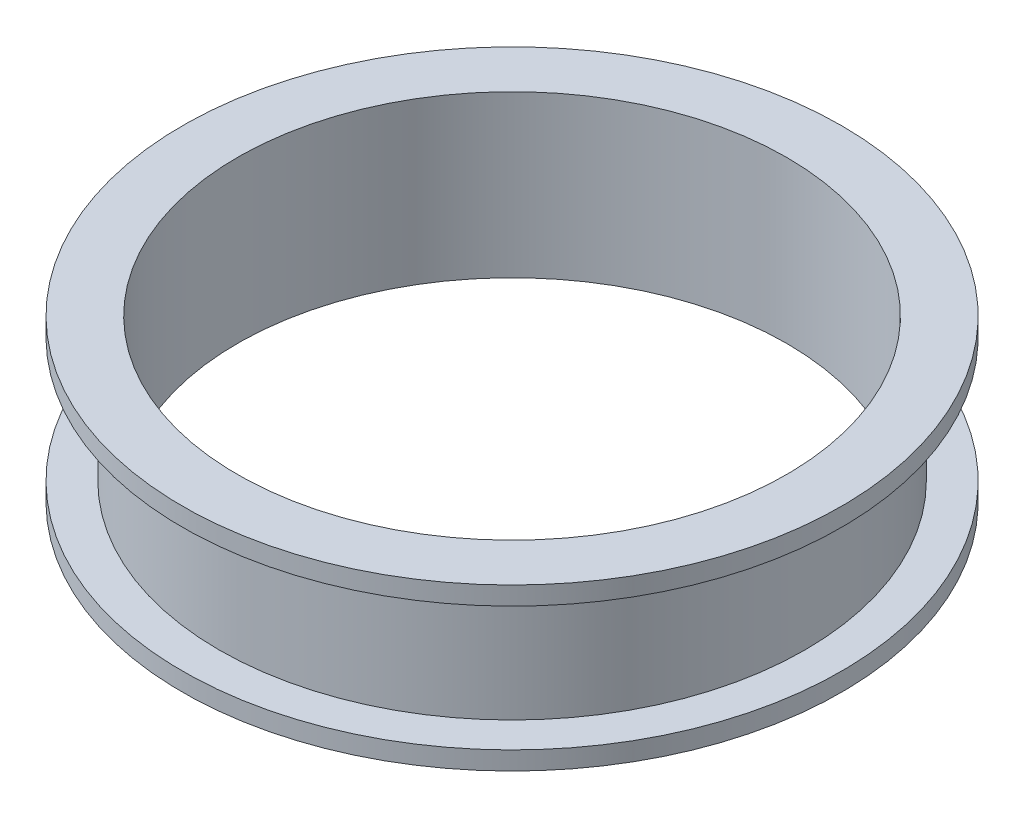
ISO-10303-21;
HEADER;
FILE_DESCRIPTION(('STEP AP214'),'2;1');
FILE_NAME('part.step','',(''),(''),'','','');
FILE_SCHEMA(('AUTOMOTIVE_DESIGN { 1 0 10303 214 1 1 1 1 }'));
ENDSEC;
DATA;
#1=APPLICATION_CONTEXT('core data for automotive mechanical design processes');
#2=APPLICATION_PROTOCOL_DEFINITION('international standard','automotive_design',2000,#1);
#3=PRODUCT_CONTEXT('',#1,'mechanical');
#4=PRODUCT('Part','Part','',(#3));
#5=PRODUCT_RELATED_PRODUCT_CATEGORY('part','',(#4));
#6=PRODUCT_DEFINITION_FORMATION('','',#4);
#7=PRODUCT_DEFINITION_CONTEXT('part definition',#1,'design');
#8=PRODUCT_DEFINITION('design','',#6,#7);
#9=PRODUCT_DEFINITION_SHAPE('','',#8);
#10=(LENGTH_UNIT() NAMED_UNIT(*) SI_UNIT(.MILLI.,.METRE.));
#11=(NAMED_UNIT(*) PLANE_ANGLE_UNIT() SI_UNIT($,.RADIAN.));
#12=(NAMED_UNIT(*) SI_UNIT($,.STERADIAN.) SOLID_ANGLE_UNIT());
#13=UNCERTAINTY_MEASURE_WITH_UNIT(LENGTH_MEASURE(1.E-05),#10,'distance_accuracy_value','');
#14=(GEOMETRIC_REPRESENTATION_CONTEXT(3) GLOBAL_UNCERTAINTY_ASSIGNED_CONTEXT((#13)) GLOBAL_UNIT_ASSIGNED_CONTEXT((#10,
#11,#12)) REPRESENTATION_CONTEXT('',''));
#15=CARTESIAN_POINT('',(0.,0.,0.));
#16=DIRECTION('',(0.,0.,1.));
#17=DIRECTION('',(1.,0.,0.));
#18=AXIS2_PLACEMENT_3D('',#15,#16,#17);
#19=CARTESIAN_POINT('',(0.,-2.5,0.));
#20=DIRECTION('',(0.,-1.,0.));
#21=DIRECTION('',(0.,0.,-1.));
#22=AXIS2_PLACEMENT_3D('',#19,#20,#21);
#23=CYLINDRICAL_SURFACE('',#22,37.5);
#24=CARTESIAN_POINT('',(0.,19.5,0.));
#25=DIRECTION('',(0.,-1.,0.));
#26=DIRECTION('',(0.,0.,-1.));
#27=AXIS2_PLACEMENT_3D('',#24,#25,#26);
#28=CIRCLE('',#27,37.5);
#29=CARTESIAN_POINT('',(0.,19.5,-37.5));
#30=VERTEX_POINT('',#29);
#31=EDGE_CURVE('E10',#30,#30,#28,.T.);
#32=ORIENTED_EDGE('',*,*,#31,.F.);
#33=EDGE_LOOP('',(#32));
#34=FACE_BOUND('',#33,.T.);
#35=CARTESIAN_POINT('',(0.,-2.5,0.));
#36=DIRECTION('',(0.,-1.,0.));
#37=DIRECTION('',(0.,0.,-1.));
#38=AXIS2_PLACEMENT_3D('',#35,#36,#37);
#39=CIRCLE('',#38,37.5);
#40=CARTESIAN_POINT('',(0.,-2.5,-37.5));
#41=VERTEX_POINT('',#40);
#42=EDGE_CURVE('E72',#41,#41,#39,.F.);
#43=ORIENTED_EDGE('',*,*,#42,.F.);
#44=EDGE_LOOP('',(#43));
#45=FACE_BOUND('',#44,.T.);
#46=ADVANCED_FACE('F37',(#34,#45),#23,.F.);
#47=CARTESIAN_POINT('',(37.5,19.5,0.));
#48=DIRECTION('',(0.,1.,0.));
#49=DIRECTION('',(0.,0.,1.));
#50=AXIS2_PLACEMENT_3D('',#47,#48,#49);
#51=PLANE('',#50);
#52=ORIENTED_EDGE('',*,*,#31,.T.);
#53=EDGE_LOOP('',(#52));
#54=FACE_BOUND('',#53,.T.);
#55=CARTESIAN_POINT('',(0.,19.5,0.));
#56=DIRECTION('',(0.,-1.,0.));
#57=DIRECTION('',(0.,0.,-1.));
#58=AXIS2_PLACEMENT_3D('',#55,#56,#57);
#59=CIRCLE('',#58,45.);
#60=CARTESIAN_POINT('',(0.,19.5,-45.));
#61=VERTEX_POINT('',#60);
#62=EDGE_CURVE('E44',#61,#61,#59,.T.);
#63=ORIENTED_EDGE('',*,*,#62,.F.);
#64=EDGE_LOOP('',(#63));
#65=FACE_BOUND('',#64,.T.);
#66=ADVANCED_FACE('F81',(#54,#65),#51,.T.);
#67=CARTESIAN_POINT('',(0.,-2.5,0.));
#68=DIRECTION('',(0.,-1.,0.));
#69=DIRECTION('',(0.,0.,-1.));
#70=AXIS2_PLACEMENT_3D('',#67,#68,#69);
#71=CYLINDRICAL_SURFACE('',#70,45.);
#72=ORIENTED_EDGE('',*,*,#62,.T.);
#73=EDGE_LOOP('',(#72));
#74=FACE_BOUND('',#73,.T.);
#75=CARTESIAN_POINT('',(0.,17.,0.));
#76=DIRECTION('',(0.,-1.,0.));
#77=DIRECTION('',(0.,0.,-1.));
#78=AXIS2_PLACEMENT_3D('',#75,#76,#77);
#79=CIRCLE('',#78,45.);
#80=CARTESIAN_POINT('',(0.,17.,-45.));
#81=VERTEX_POINT('',#80);
#82=EDGE_CURVE('E49',#81,#81,#79,.T.);
#83=ORIENTED_EDGE('',*,*,#82,.F.);
#84=EDGE_LOOP('',(#83));
#85=FACE_BOUND('',#84,.T.);
#86=ADVANCED_FACE('F86',(#74,#85),#71,.T.);
#87=CARTESIAN_POINT('',(45.,17.,0.));
#88=DIRECTION('',(0.,-1.,0.));
#89=DIRECTION('',(0.,0.,-1.));
#90=AXIS2_PLACEMENT_3D('',#87,#88,#89);
#91=PLANE('',#90);
#92=ORIENTED_EDGE('',*,*,#82,.T.);
#93=EDGE_LOOP('',(#92));
#94=FACE_BOUND('',#93,.T.);
#95=CARTESIAN_POINT('',(0.,17.,0.));
#96=DIRECTION('',(0.,-1.,0.));
#97=DIRECTION('',(0.,0.,-1.));
#98=AXIS2_PLACEMENT_3D('',#95,#96,#97);
#99=CIRCLE('',#98,40.);
#100=CARTESIAN_POINT('',(0.,17.,-40.));
#101=VERTEX_POINT('',#100);
#102=EDGE_CURVE('E54',#101,#101,#99,.T.);
#103=ORIENTED_EDGE('',*,*,#102,.F.);
#104=EDGE_LOOP('',(#103));
#105=FACE_BOUND('',#104,.T.);
#106=ADVANCED_FACE('F90',(#94,#105),#91,.T.);
#107=CARTESIAN_POINT('',(0.,-2.5,0.));
#108=DIRECTION('',(0.,-1.,0.));
#109=DIRECTION('',(0.,0.,-1.));
#110=AXIS2_PLACEMENT_3D('',#107,#108,#109);
#111=CYLINDRICAL_SURFACE('',#110,40.);
#112=ORIENTED_EDGE('',*,*,#102,.T.);
#113=EDGE_LOOP('',(#112));
#114=FACE_BOUND('',#113,.T.);
#115=CARTESIAN_POINT('',(0.,0.,0.));
#116=DIRECTION('',(0.,-1.,0.));
#117=DIRECTION('',(0.,0.,-1.));
#118=AXIS2_PLACEMENT_3D('',#115,#116,#117);
#119=CIRCLE('',#118,40.);
#120=CARTESIAN_POINT('',(0.,0.,-40.));
#121=VERTEX_POINT('',#120);
#122=EDGE_CURVE('E60',#121,#121,#119,.T.);
#123=ORIENTED_EDGE('',*,*,#122,.F.);
#124=EDGE_LOOP('',(#123));
#125=FACE_BOUND('',#124,.T.);
#126=ADVANCED_FACE('F96',(#114,#125),#111,.T.);
#127=CARTESIAN_POINT('',(40.,0.,0.));
#128=DIRECTION('',(0.,1.,0.));
#129=DIRECTION('',(0.,0.,1.));
#130=AXIS2_PLACEMENT_3D('',#127,#128,#129);
#131=PLANE('',#130);
#132=ORIENTED_EDGE('',*,*,#122,.T.);
#133=EDGE_LOOP('',(#132));
#134=FACE_BOUND('',#133,.T.);
#135=CARTESIAN_POINT('',(0.,0.,0.));
#136=DIRECTION('',(0.,-1.,0.));
#137=DIRECTION('',(0.,0.,-1.));
#138=AXIS2_PLACEMENT_3D('',#135,#136,#137);
#139=CIRCLE('',#138,45.);
#140=CARTESIAN_POINT('',(0.,0.,-45.));
#141=VERTEX_POINT('',#140);
#142=EDGE_CURVE('E64',#141,#141,#139,.T.);
#143=ORIENTED_EDGE('',*,*,#142,.F.);
#144=EDGE_LOOP('',(#143));
#145=FACE_BOUND('',#144,.T.);
#146=ADVANCED_FACE('F100',(#134,#145),#131,.T.);
#147=CARTESIAN_POINT('',(0.,-2.5,0.));
#148=DIRECTION('',(0.,-1.,0.));
#149=DIRECTION('',(0.,0.,-1.));
#150=AXIS2_PLACEMENT_3D('',#147,#148,#149);
#151=CYLINDRICAL_SURFACE('',#150,45.);
#152=ORIENTED_EDGE('',*,*,#142,.T.);
#153=EDGE_LOOP('',(#152));
#154=FACE_BOUND('',#153,.T.);
#155=CARTESIAN_POINT('',(0.,-2.5,0.));
#156=DIRECTION('',(0.,-1.,0.));
#157=DIRECTION('',(0.,0.,-1.));
#158=AXIS2_PLACEMENT_3D('',#155,#156,#157);
#159=CIRCLE('',#158,45.);
#160=CARTESIAN_POINT('',(0.,-2.5,-45.));
#161=VERTEX_POINT('',#160);
#162=EDGE_CURVE('E68',#161,#161,#159,.T.);
#163=ORIENTED_EDGE('',*,*,#162,.F.);
#164=EDGE_LOOP('',(#163));
#165=FACE_BOUND('',#164,.T.);
#166=ADVANCED_FACE('F104',(#154,#165),#151,.T.);
#167=CARTESIAN_POINT('',(45.,-2.5,0.));
#168=DIRECTION('',(0.,-1.,0.));
#169=DIRECTION('',(0.,0.,-1.));
#170=AXIS2_PLACEMENT_3D('',#167,#168,#169);
#171=PLANE('',#170);
#172=ORIENTED_EDGE('',*,*,#42,.T.);
#173=EDGE_LOOP('',(#172));
#174=FACE_BOUND('',#173,.T.);
#175=ORIENTED_EDGE('',*,*,#162,.T.);
#176=EDGE_LOOP('',(#175));
#177=FACE_BOUND('',#176,.T.);
#178=ADVANCED_FACE('F77',(#174,#177),#171,.T.);
#179=CLOSED_SHELL('',(#46,#66,#86,#106,#126,#146,#166,#178));
#180=MANIFOLD_SOLID_BREP('B2',#179);
#181=ADVANCED_BREP_SHAPE_REPRESENTATION('',(#18,#180),#14);
#182=SHAPE_DEFINITION_REPRESENTATION(#9,#181);
ENDSEC;
END-ISO-10303-21;
